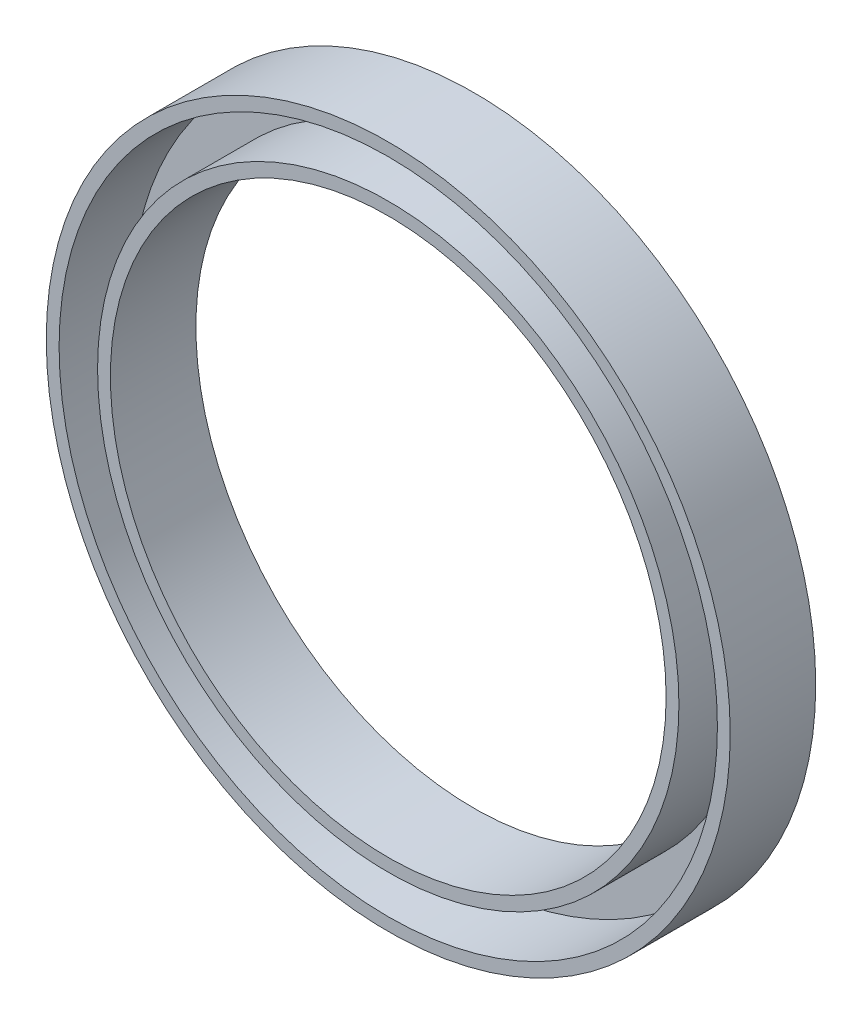
ISO-10303-21;
HEADER;
FILE_DESCRIPTION(('STEP AP214'),'2;1');
FILE_NAME('part.step','',(''),(''),'','','');
FILE_SCHEMA(('AUTOMOTIVE_DESIGN { 1 0 10303 214 1 1 1 1 }'));
ENDSEC;
DATA;
#1=APPLICATION_CONTEXT('core data for automotive mechanical design processes');
#2=APPLICATION_PROTOCOL_DEFINITION('international standard','automotive_design',2000,#1);
#3=PRODUCT_CONTEXT('',#1,'mechanical');
#4=PRODUCT('Part','Part','',(#3));
#5=PRODUCT_RELATED_PRODUCT_CATEGORY('part','',(#4));
#6=PRODUCT_DEFINITION_FORMATION('','',#4);
#7=PRODUCT_DEFINITION_CONTEXT('part definition',#1,'design');
#8=PRODUCT_DEFINITION('design','',#6,#7);
#9=PRODUCT_DEFINITION_SHAPE('','',#8);
#10=(LENGTH_UNIT() NAMED_UNIT(*) SI_UNIT(.MILLI.,.METRE.));
#11=(NAMED_UNIT(*) PLANE_ANGLE_UNIT() SI_UNIT($,.RADIAN.));
#12=(NAMED_UNIT(*) SI_UNIT($,.STERADIAN.) SOLID_ANGLE_UNIT());
#13=UNCERTAINTY_MEASURE_WITH_UNIT(LENGTH_MEASURE(1.E-05),#10,'distance_accuracy_value','');
#14=(GEOMETRIC_REPRESENTATION_CONTEXT(3) GLOBAL_UNCERTAINTY_ASSIGNED_CONTEXT((#13)) GLOBAL_UNIT_ASSIGNED_CONTEXT((#10,
#11,#12)) REPRESENTATION_CONTEXT('',''));
#15=CARTESIAN_POINT('',(0.,0.,0.));
#16=DIRECTION('',(0.,0.,1.));
#17=DIRECTION('',(1.,0.,0.));
#18=AXIS2_PLACEMENT_3D('',#15,#16,#17);
#19=CARTESIAN_POINT('',(0.,0.,10.));
#20=DIRECTION('',(0.,0.,1.));
#21=DIRECTION('',(1.,0.,0.));
#22=AXIS2_PLACEMENT_3D('',#19,#20,#21);
#23=PLANE('',#22);
#24=CARTESIAN_POINT('',(0.,0.,10.));
#25=DIRECTION('',(0.,0.,1.));
#26=DIRECTION('',(1.,0.,0.));
#27=AXIS2_PLACEMENT_3D('',#24,#25,#26);
#28=CIRCLE('',#27,32.5);
#29=CARTESIAN_POINT('',(32.5,0.,10.));
#30=VERTEX_POINT('',#29);
#31=EDGE_CURVE('E41',#30,#30,#28,.T.);
#32=ORIENTED_EDGE('',*,*,#31,.F.);
#33=EDGE_LOOP('',(#32));
#34=FACE_BOUND('',#33,.T.);
#35=CARTESIAN_POINT('',(0.,0.,10.));
#36=DIRECTION('',(0.,0.,1.));
#37=DIRECTION('',(1.,0.,0.));
#38=AXIS2_PLACEMENT_3D('',#35,#36,#37);
#39=CIRCLE('',#38,34.);
#40=CARTESIAN_POINT('',(34.,0.,10.));
#41=VERTEX_POINT('',#40);
#42=EDGE_CURVE('E49',#41,#41,#39,.T.);
#43=ORIENTED_EDGE('',*,*,#42,.T.);
#44=EDGE_LOOP('',(#43));
#45=FACE_BOUND('',#44,.T.);
#46=ADVANCED_FACE('F30',(#34,#45),#23,.T.);
#47=CARTESIAN_POINT('',(0.,0.,10.));
#48=DIRECTION('',(0.,0.,1.));
#49=DIRECTION('',(1.,0.,0.));
#50=AXIS2_PLACEMENT_3D('',#47,#48,#49);
#51=CIRCLE('',#50,38.5);
#52=CARTESIAN_POINT('',(38.5,0.,10.));
#53=VERTEX_POINT('',#52);
#54=EDGE_CURVE('E46',#53,#53,#51,.T.);
#55=ORIENTED_EDGE('',*,*,#54,.F.);
#56=EDGE_LOOP('',(#55));
#57=FACE_BOUND('',#56,.T.);
#58=CARTESIAN_POINT('',(0.,0.,10.));
#59=DIRECTION('',(0.,0.,1.));
#60=DIRECTION('',(1.,0.,0.));
#61=AXIS2_PLACEMENT_3D('',#58,#59,#60);
#62=CIRCLE('',#61,40.);
#63=CARTESIAN_POINT('',(40.,0.,10.));
#64=VERTEX_POINT('',#63);
#65=EDGE_CURVE('E10',#64,#64,#62,.T.);
#66=ORIENTED_EDGE('',*,*,#65,.T.);
#67=EDGE_LOOP('',(#66));
#68=FACE_BOUND('',#67,.T.);
#69=ADVANCED_FACE('F78',(#57,#68),#23,.T.);
#70=CARTESIAN_POINT('',(0.,0.,0.));
#71=DIRECTION('',(0.,0.,1.));
#72=DIRECTION('',(1.,0.,0.));
#73=AXIS2_PLACEMENT_3D('',#70,#71,#72);
#74=PLANE('',#73);
#75=CARTESIAN_POINT('',(0.,0.,0.));
#76=DIRECTION('',(0.,0.,1.));
#77=DIRECTION('',(1.,0.,0.));
#78=AXIS2_PLACEMENT_3D('',#75,#76,#77);
#79=CIRCLE('',#78,40.);
#80=CARTESIAN_POINT('',(40.,0.,0.));
#81=VERTEX_POINT('',#80);
#82=EDGE_CURVE('E34',#81,#81,#79,.T.);
#83=ORIENTED_EDGE('',*,*,#82,.F.);
#84=EDGE_LOOP('',(#83));
#85=FACE_BOUND('',#84,.T.);
#86=CARTESIAN_POINT('',(0.,0.,0.));
#87=DIRECTION('',(0.,0.,1.));
#88=DIRECTION('',(1.,0.,0.));
#89=AXIS2_PLACEMENT_3D('',#86,#87,#88);
#90=CIRCLE('',#89,32.5);
#91=CARTESIAN_POINT('',(32.5,0.,0.));
#92=VERTEX_POINT('',#91);
#93=EDGE_CURVE('E43',#92,#92,#90,.T.);
#94=ORIENTED_EDGE('',*,*,#93,.T.);
#95=EDGE_LOOP('',(#94));
#96=FACE_BOUND('',#95,.T.);
#97=ADVANCED_FACE('F84',(#85,#96),#74,.F.);
#98=CARTESIAN_POINT('',(0.,0.,10.));
#99=DIRECTION('',(0.,0.,-1.));
#100=DIRECTION('',(-1.,0.,0.));
#101=AXIS2_PLACEMENT_3D('',#98,#99,#100);
#102=CYLINDRICAL_SURFACE('',#101,40.);
#103=ORIENTED_EDGE('',*,*,#65,.F.);
#104=EDGE_LOOP('',(#103));
#105=FACE_BOUND('',#104,.T.);
#106=ORIENTED_EDGE('',*,*,#82,.T.);
#107=EDGE_LOOP('',(#106));
#108=FACE_BOUND('',#107,.T.);
#109=ADVANCED_FACE('F32',(#105,#108),#102,.T.);
#110=CARTESIAN_POINT('',(0.,0.,10.));
#111=DIRECTION('',(0.,0.,-1.));
#112=DIRECTION('',(-1.,0.,0.));
#113=AXIS2_PLACEMENT_3D('',#110,#111,#112);
#114=CYLINDRICAL_SURFACE('',#113,32.5);
#115=ORIENTED_EDGE('',*,*,#31,.T.);
#116=EDGE_LOOP('',(#115));
#117=FACE_BOUND('',#116,.T.);
#118=ORIENTED_EDGE('',*,*,#93,.F.);
#119=EDGE_LOOP('',(#118));
#120=FACE_BOUND('',#119,.T.);
#121=ADVANCED_FACE('F75',(#117,#120),#114,.F.);
#122=CARTESIAN_POINT('',(0.,0.,1.5));
#123=DIRECTION('',(0.,0.,1.));
#124=DIRECTION('',(1.,0.,0.));
#125=AXIS2_PLACEMENT_3D('',#122,#123,#124);
#126=PLANE('',#125);
#127=CARTESIAN_POINT('',(0.,0.,1.5));
#128=DIRECTION('',(0.,0.,1.));
#129=DIRECTION('',(1.,0.,0.));
#130=AXIS2_PLACEMENT_3D('',#127,#128,#129);
#131=CIRCLE('',#130,38.5);
#132=CARTESIAN_POINT('',(38.5,0.,1.5));
#133=VERTEX_POINT('',#132);
#134=EDGE_CURVE('E52',#133,#133,#131,.T.);
#135=ORIENTED_EDGE('',*,*,#134,.T.);
#136=EDGE_LOOP('',(#135));
#137=FACE_BOUND('',#136,.T.);
#138=CARTESIAN_POINT('',(0.,0.,1.5));
#139=DIRECTION('',(0.,0.,1.));
#140=DIRECTION('',(1.,0.,0.));
#141=AXIS2_PLACEMENT_3D('',#138,#139,#140);
#142=CIRCLE('',#141,34.);
#143=CARTESIAN_POINT('',(34.,0.,1.5));
#144=VERTEX_POINT('',#143);
#145=EDGE_CURVE('E53',#144,#144,#142,.T.);
#146=ORIENTED_EDGE('',*,*,#145,.F.);
#147=EDGE_LOOP('',(#146));
#148=FACE_BOUND('',#147,.T.);
#149=ADVANCED_FACE('F61',(#137,#148),#126,.T.);
#150=CARTESIAN_POINT('',(0.,0.,10.));
#151=DIRECTION('',(0.,0.,-1.));
#152=DIRECTION('',(-1.,0.,0.));
#153=AXIS2_PLACEMENT_3D('',#150,#151,#152);
#154=CYLINDRICAL_SURFACE('',#153,38.5);
#155=ORIENTED_EDGE('',*,*,#54,.T.);
#156=EDGE_LOOP('',(#155));
#157=FACE_BOUND('',#156,.T.);
#158=ORIENTED_EDGE('',*,*,#134,.F.);
#159=EDGE_LOOP('',(#158));
#160=FACE_BOUND('',#159,.T.);
#161=ADVANCED_FACE('F64',(#157,#160),#154,.F.);
#162=CARTESIAN_POINT('',(0.,0.,10.));
#163=DIRECTION('',(0.,0.,-1.));
#164=DIRECTION('',(-1.,0.,0.));
#165=AXIS2_PLACEMENT_3D('',#162,#163,#164);
#166=CYLINDRICAL_SURFACE('',#165,34.);
#167=ORIENTED_EDGE('',*,*,#42,.F.);
#168=EDGE_LOOP('',(#167));
#169=FACE_BOUND('',#168,.T.);
#170=ORIENTED_EDGE('',*,*,#145,.T.);
#171=EDGE_LOOP('',(#170));
#172=FACE_BOUND('',#171,.T.);
#173=ADVANCED_FACE('F66',(#169,#172),#166,.T.);
#174=CLOSED_SHELL('',(#46,#69,#97,#109,#121,#149,#161,#173));
#175=MANIFOLD_SOLID_BREP('B2',#174);
#176=ADVANCED_BREP_SHAPE_REPRESENTATION('',(#18,#175),#14);
#177=SHAPE_DEFINITION_REPRESENTATION(#9,#176);
ENDSEC;
END-ISO-10303-21;
